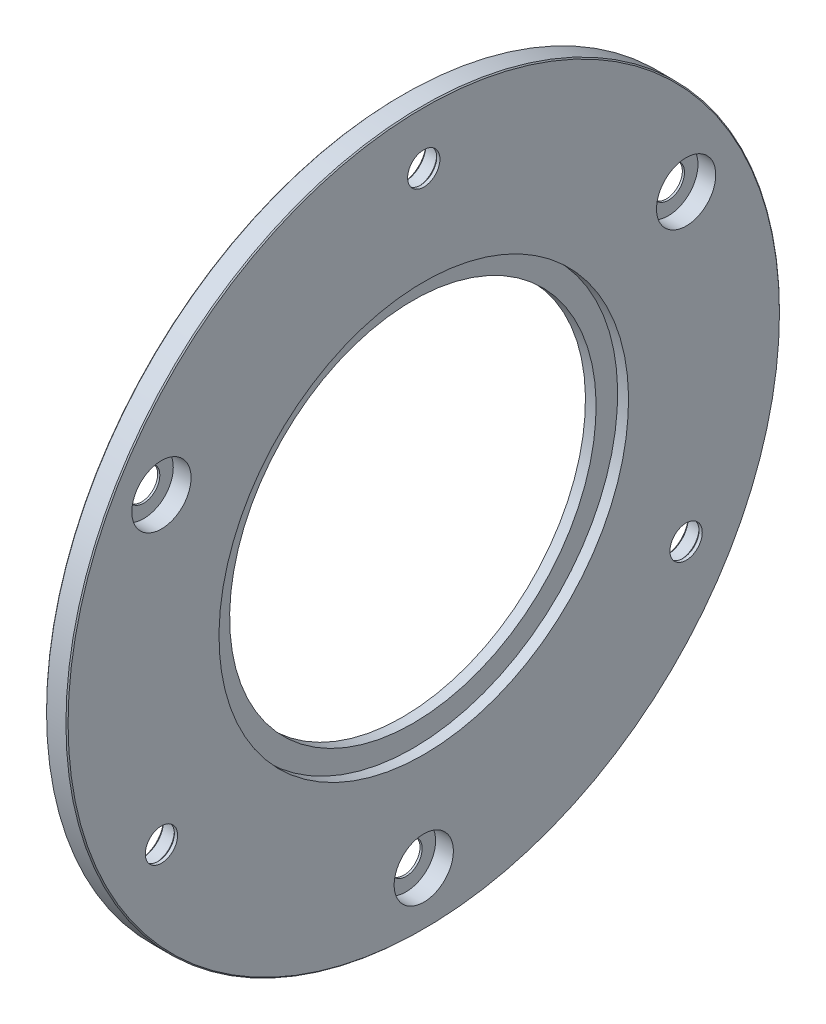
ISO-10303-21;
HEADER;
FILE_DESCRIPTION(('STEP AP214'),'2;1');
FILE_NAME('part.step','',(''),(''),'','','');
FILE_SCHEMA(('AUTOMOTIVE_DESIGN { 1 0 10303 214 1 1 1 1 }'));
ENDSEC;
DATA;
#1=APPLICATION_CONTEXT('core data for automotive mechanical design processes');
#2=APPLICATION_PROTOCOL_DEFINITION('international standard','automotive_design',2000,#1);
#3=PRODUCT_CONTEXT('',#1,'mechanical');
#4=PRODUCT('Part','Part','',(#3));
#5=PRODUCT_RELATED_PRODUCT_CATEGORY('part','',(#4));
#6=PRODUCT_DEFINITION_FORMATION('','',#4);
#7=PRODUCT_DEFINITION_CONTEXT('part definition',#1,'design');
#8=PRODUCT_DEFINITION('design','',#6,#7);
#9=PRODUCT_DEFINITION_SHAPE('','',#8);
#10=(LENGTH_UNIT() NAMED_UNIT(*) SI_UNIT(.MILLI.,.METRE.));
#11=(NAMED_UNIT(*) PLANE_ANGLE_UNIT() SI_UNIT($,.RADIAN.));
#12=(NAMED_UNIT(*) SI_UNIT($,.STERADIAN.) SOLID_ANGLE_UNIT());
#13=UNCERTAINTY_MEASURE_WITH_UNIT(LENGTH_MEASURE(1.E-05),#10,'distance_accuracy_value','');
#14=(GEOMETRIC_REPRESENTATION_CONTEXT(3) GLOBAL_UNCERTAINTY_ASSIGNED_CONTEXT((#13)) GLOBAL_UNIT_ASSIGNED_CONTEXT((#10,
#11,#12)) REPRESENTATION_CONTEXT('',''));
#15=CARTESIAN_POINT('',(0.,0.,0.));
#16=DIRECTION('',(0.,0.,1.));
#17=DIRECTION('',(1.,0.,0.));
#18=AXIS2_PLACEMENT_3D('',#15,#16,#17);
#19=CARTESIAN_POINT('',(34.,0.,0.));
#20=DIRECTION('',(1.,0.,0.));
#21=DIRECTION('',(0.,0.,-1.));
#22=AXIS2_PLACEMENT_3D('',#19,#20,#21);
#23=PLANE('',#22);
#24=CARTESIAN_POINT('',(34.,-28.1250000000002,48.7139289628746));
#25=DIRECTION('',(1.,0.,0.));
#26=DIRECTION('',(0.,0.,-1.));
#27=AXIS2_PLACEMENT_3D('',#24,#25,#26);
#28=CIRCLE('',#27,3.8);
#29=CARTESIAN_POINT('',(34.,-28.1250000000002,44.9139289628746));
#30=VERTEX_POINT('',#29);
#31=EDGE_CURVE('E71',#30,#30,#28,.F.);
#32=ORIENTED_EDGE('',*,*,#31,.T.);
#33=EDGE_LOOP('',(#32));
#34=FACE_BOUND('',#33,.T.);
#35=CARTESIAN_POINT('',(34.,-28.1250000000002,48.7139289628746));
#36=DIRECTION('',(1.,0.,0.));
#37=DIRECTION('',(0.,0.,-1.));
#38=AXIS2_PLACEMENT_3D('',#35,#36,#37);
#39=CIRCLE('',#38,3.39999999999993);
#40=CARTESIAN_POINT('',(34.,-28.1250000000002,45.3139289628746));
#41=VERTEX_POINT('',#40);
#42=EDGE_CURVE('E98',#41,#41,#39,.T.);
#43=ORIENTED_EDGE('',*,*,#42,.T.);
#44=EDGE_LOOP('',(#43));
#45=FACE_BOUND('',#44,.T.);
#46=ADVANCED_FACE('F34',(#34,#45),#23,.F.);
#47=CARTESIAN_POINT('',(34.,0.,0.));
#48=DIRECTION('',(1.,0.,0.));
#49=DIRECTION('',(0.,0.,-1.));
#50=AXIS2_PLACEMENT_3D('',#47,#48,#49);
#51=PLANE('',#50);
#52=CARTESIAN_POINT('',(34.,-28.1249999999995,-48.7139289628749));
#53=DIRECTION('',(1.,0.,0.));
#54=DIRECTION('',(0.,0.,-1.));
#55=AXIS2_PLACEMENT_3D('',#52,#53,#54);
#56=CIRCLE('',#55,3.8);
#57=CARTESIAN_POINT('',(34.,-28.1249999999995,-52.5139289628749));
#58=VERTEX_POINT('',#57);
#59=EDGE_CURVE('E55',#58,#58,#56,.F.);
#60=ORIENTED_EDGE('',*,*,#59,.T.);
#61=EDGE_LOOP('',(#60));
#62=FACE_BOUND('',#61,.T.);
#63=CARTESIAN_POINT('',(34.,-28.1249999999995,-48.7139289628749));
#64=DIRECTION('',(1.,0.,0.));
#65=DIRECTION('',(0.,0.,-1.));
#66=AXIS2_PLACEMENT_3D('',#63,#64,#65);
#67=CIRCLE('',#66,3.39999999999993);
#68=CARTESIAN_POINT('',(34.,-28.1249999999995,-52.1139289628749));
#69=VERTEX_POINT('',#68);
#70=EDGE_CURVE('E86',#69,#69,#67,.T.);
#71=ORIENTED_EDGE('',*,*,#70,.T.);
#72=EDGE_LOOP('',(#71));
#73=FACE_BOUND('',#72,.T.);
#74=ADVANCED_FACE('F241',(#62,#73),#51,.F.);
#75=CARTESIAN_POINT('',(34.,0.,0.));
#76=DIRECTION('',(1.,0.,0.));
#77=DIRECTION('',(0.,0.,-1.));
#78=AXIS2_PLACEMENT_3D('',#75,#76,#77);
#79=PLANE('',#78);
#80=CARTESIAN_POINT('',(34.,56.25,0.));
#81=DIRECTION('',(1.,0.,0.));
#82=DIRECTION('',(0.,0.,-1.));
#83=AXIS2_PLACEMENT_3D('',#80,#81,#82);
#84=CIRCLE('',#83,3.8);
#85=CARTESIAN_POINT('',(34.,56.25,-3.8));
#86=VERTEX_POINT('',#85);
#87=EDGE_CURVE('E101',#86,#86,#84,.F.);
#88=ORIENTED_EDGE('',*,*,#87,.T.);
#89=EDGE_LOOP('',(#88));
#90=FACE_BOUND('',#89,.T.);
#91=CARTESIAN_POINT('',(34.,56.25,0.));
#92=DIRECTION('',(1.,0.,0.));
#93=DIRECTION('',(0.,0.,-1.));
#94=AXIS2_PLACEMENT_3D('',#91,#92,#93);
#95=CIRCLE('',#94,3.39999999999999);
#96=CARTESIAN_POINT('',(34.,56.25,-3.39999999999999));
#97=VERTEX_POINT('',#96);
#98=EDGE_CURVE('E121',#97,#97,#95,.T.);
#99=ORIENTED_EDGE('',*,*,#98,.T.);
#100=EDGE_LOOP('',(#99));
#101=FACE_BOUND('',#100,.T.);
#102=ADVANCED_FACE('F247',(#90,#101),#79,.F.);
#103=CARTESIAN_POINT('',(33.8,56.25,0.));
#104=DIRECTION('',(1.,0.,0.));
#105=DIRECTION('',(0.,0.,-1.));
#106=AXIS2_PLACEMENT_3D('',#103,#104,#105);
#107=TOROIDAL_SURFACE('',#106,3.8,0.2);
#108=ORIENTED_EDGE('',*,*,#87,.F.);
#109=EDGE_LOOP('',(#108));
#110=FACE_BOUND('',#109,.T.);
#111=CARTESIAN_POINT('',(33.8,56.25,0.));
#112=DIRECTION('',(1.,0.,0.));
#113=DIRECTION('',(0.,0.,-1.));
#114=AXIS2_PLACEMENT_3D('',#111,#112,#113);
#115=CIRCLE('',#114,4.);
#116=CARTESIAN_POINT('',(33.8,56.25,-4.));
#117=VERTEX_POINT('',#116);
#118=EDGE_CURVE('E109',#117,#117,#115,.T.);
#119=ORIENTED_EDGE('',*,*,#118,.F.);
#120=EDGE_LOOP('',(#119));
#121=FACE_BOUND('',#120,.T.);
#122=ADVANCED_FACE('F289',(#110,#121),#107,.F.);
#123=CARTESIAN_POINT('',(35.,28.125,-48.7139289628747));
#124=DIRECTION('',(1.,0.,0.));
#125=DIRECTION('',(0.,0.,-1.));
#126=AXIS2_PLACEMENT_3D('',#123,#124,#125);
#127=CYLINDRICAL_SURFACE('',#126,3.);
#128=CARTESIAN_POINT('',(31.7,28.125,-48.7139289628747));
#129=DIRECTION('',(1.,0.,0.));
#130=DIRECTION('',(0.,0.,-1.));
#131=AXIS2_PLACEMENT_3D('',#128,#129,#130);
#132=CIRCLE('',#131,3.);
#133=CARTESIAN_POINT('',(31.7,28.125,-51.7139289628747));
#134=VERTEX_POINT('',#133);
#135=EDGE_CURVE('E106',#134,#134,#132,.T.);
#136=ORIENTED_EDGE('',*,*,#135,.T.);
#137=EDGE_LOOP('',(#136));
#138=FACE_BOUND('',#137,.T.);
#139=CARTESIAN_POINT('',(31.3,28.125,-48.7139289628747));
#140=DIRECTION('',(1.,0.,0.));
#141=DIRECTION('',(0.,0.,-1.));
#142=AXIS2_PLACEMENT_3D('',#139,#140,#141);
#143=CIRCLE('',#142,3.);
#144=CARTESIAN_POINT('',(31.3,28.125,-51.7139289628747));
#145=VERTEX_POINT('',#144);
#146=EDGE_CURVE('E102',#145,#145,#143,.T.);
#147=ORIENTED_EDGE('',*,*,#146,.F.);
#148=EDGE_LOOP('',(#147));
#149=FACE_BOUND('',#148,.T.);
#150=ADVANCED_FACE('F285',(#138,#149),#127,.F.);
#151=CARTESIAN_POINT('',(33.8,-28.1250000000002,48.7139289628746));
#152=DIRECTION('',(1.,0.,0.));
#153=DIRECTION('',(0.,0.,-1.));
#154=AXIS2_PLACEMENT_3D('',#151,#152,#153);
#155=TOROIDAL_SURFACE('',#154,3.8,0.2);
#156=ORIENTED_EDGE('',*,*,#31,.F.);
#157=EDGE_LOOP('',(#156));
#158=FACE_BOUND('',#157,.T.);
#159=CARTESIAN_POINT('',(33.8,-28.1250000000002,48.7139289628746));
#160=DIRECTION('',(1.,0.,0.));
#161=DIRECTION('',(0.,0.,-1.));
#162=AXIS2_PLACEMENT_3D('',#159,#160,#161);
#163=CIRCLE('',#162,4.);
#164=CARTESIAN_POINT('',(33.8,-28.1250000000002,44.7139289628746));
#165=VERTEX_POINT('',#164);
#166=EDGE_CURVE('E74',#165,#165,#163,.T.);
#167=ORIENTED_EDGE('',*,*,#166,.F.);
#168=EDGE_LOOP('',(#167));
#169=FACE_BOUND('',#168,.T.);
#170=ADVANCED_FACE('F288',(#158,#169),#155,.F.);
#171=CARTESIAN_POINT('',(33.8,-28.1249999999995,-48.7139289628749));
#172=DIRECTION('',(1.,0.,0.));
#173=DIRECTION('',(0.,0.,-1.));
#174=AXIS2_PLACEMENT_3D('',#171,#172,#173);
#175=TOROIDAL_SURFACE('',#174,3.8,0.2);
#176=ORIENTED_EDGE('',*,*,#59,.F.);
#177=EDGE_LOOP('',(#176));
#178=FACE_BOUND('',#177,.T.);
#179=CARTESIAN_POINT('',(33.8,-28.1249999999995,-48.7139289628749));
#180=DIRECTION('',(1.,0.,0.));
#181=DIRECTION('',(0.,0.,-1.));
#182=AXIS2_PLACEMENT_3D('',#179,#180,#181);
#183=CIRCLE('',#182,4.);
#184=CARTESIAN_POINT('',(33.8,-28.1249999999995,-52.7139289628749));
#185=VERTEX_POINT('',#184);
#186=EDGE_CURVE('E68',#185,#185,#183,.T.);
#187=ORIENTED_EDGE('',*,*,#186,.F.);
#188=EDGE_LOOP('',(#187));
#189=FACE_BOUND('',#188,.T.);
#190=ADVANCED_FACE('F354',(#178,#189),#175,.F.);
#191=CARTESIAN_POINT('',(35.,-56.25,-5.27355936696949E-13));
#192=DIRECTION('',(1.,0.,0.));
#193=DIRECTION('',(0.,0.,-1.));
#194=AXIS2_PLACEMENT_3D('',#191,#192,#193);
#195=CYLINDRICAL_SURFACE('',#194,3.);
#196=CARTESIAN_POINT('',(31.7,-56.25,-5.27355936696949E-13));
#197=DIRECTION('',(1.,0.,0.));
#198=DIRECTION('',(0.,0.,-1.));
#199=AXIS2_PLACEMENT_3D('',#196,#197,#198);
#200=CIRCLE('',#199,3.);
#201=CARTESIAN_POINT('',(31.7,-56.25,-3.00000000000053));
#202=VERTEX_POINT('',#201);
#203=EDGE_CURVE('E60',#202,#202,#200,.T.);
#204=ORIENTED_EDGE('',*,*,#203,.T.);
#205=EDGE_LOOP('',(#204));
#206=FACE_BOUND('',#205,.T.);
#207=CARTESIAN_POINT('',(31.3,-56.25,-5.27355936696949E-13));
#208=DIRECTION('',(1.,0.,0.));
#209=DIRECTION('',(0.,0.,-1.));
#210=AXIS2_PLACEMENT_3D('',#207,#208,#209);
#211=CIRCLE('',#210,3.);
#212=CARTESIAN_POINT('',(31.3,-56.25,-3.00000000000053));
#213=VERTEX_POINT('',#212);
#214=EDGE_CURVE('E56',#213,#213,#211,.T.);
#215=ORIENTED_EDGE('',*,*,#214,.F.);
#216=EDGE_LOOP('',(#215));
#217=FACE_BOUND('',#216,.T.);
#218=ADVANCED_FACE('F352',(#206,#217),#195,.F.);
#219=CARTESIAN_POINT('',(35.,28.1249999999998,48.7139289628748));
#220=DIRECTION('',(1.,0.,0.));
#221=DIRECTION('',(0.,0.,-1.));
#222=AXIS2_PLACEMENT_3D('',#219,#220,#221);
#223=CYLINDRICAL_SURFACE('',#222,3.);
#224=CARTESIAN_POINT('',(31.7,28.1249999999998,48.7139289628748));
#225=DIRECTION('',(1.,0.,0.));
#226=DIRECTION('',(0.,0.,-1.));
#227=AXIS2_PLACEMENT_3D('',#224,#225,#226);
#228=CIRCLE('',#227,3.);
#229=CARTESIAN_POINT('',(31.7,28.1249999999998,45.7139289628748));
#230=VERTEX_POINT('',#229);
#231=EDGE_CURVE('E65',#230,#230,#228,.T.);
#232=ORIENTED_EDGE('',*,*,#231,.T.);
#233=EDGE_LOOP('',(#232));
#234=FACE_BOUND('',#233,.T.);
#235=CARTESIAN_POINT('',(31.3,28.1249999999998,48.7139289628748));
#236=DIRECTION('',(1.,0.,0.));
#237=DIRECTION('',(0.,0.,-1.));
#238=AXIS2_PLACEMENT_3D('',#235,#236,#237);
#239=CIRCLE('',#238,3.);
#240=CARTESIAN_POINT('',(31.3,28.1249999999998,45.7139289628748));
#241=VERTEX_POINT('',#240);
#242=EDGE_CURVE('E61',#241,#241,#239,.T.);
#243=ORIENTED_EDGE('',*,*,#242,.F.);
#244=EDGE_LOOP('',(#243));
#245=FACE_BOUND('',#244,.T.);
#246=ADVANCED_FACE('F350',(#234,#245),#223,.F.);
#247=CARTESIAN_POINT('',(31.7,-53.25,-5.27355936696949E-13));
#248=DIRECTION('',(-1.,0.,0.));
#249=DIRECTION('',(0.,0.,1.));
#250=AXIS2_PLACEMENT_3D('',#247,#248,#249);
#251=PLANE('',#250);
#252=ORIENTED_EDGE('',*,*,#203,.F.);
#253=EDGE_LOOP('',(#252));
#254=FACE_BOUND('',#253,.T.);
#255=CARTESIAN_POINT('',(31.7,-56.25,-5.27355936696949E-13));
#256=DIRECTION('',(1.,0.,0.));
#257=DIRECTION('',(0.,0.,-1.));
#258=AXIS2_PLACEMENT_3D('',#255,#256,#257);
#259=CIRCLE('',#258,5.5);
#260=CARTESIAN_POINT('',(31.7,-56.25,-5.50000000000052));
#261=VERTEX_POINT('',#260);
#262=EDGE_CURVE('E166',#261,#261,#259,.T.);
#263=ORIENTED_EDGE('',*,*,#262,.T.);
#264=EDGE_LOOP('',(#263));
#265=FACE_BOUND('',#264,.T.);
#266=ADVANCED_FACE('F346',(#254,#265),#251,.F.);
#267=CARTESIAN_POINT('',(31.7,31.1249999999998,48.7139289628748));
#268=DIRECTION('',(-1.,0.,0.));
#269=DIRECTION('',(0.,0.,1.));
#270=AXIS2_PLACEMENT_3D('',#267,#268,#269);
#271=PLANE('',#270);
#272=ORIENTED_EDGE('',*,*,#231,.F.);
#273=EDGE_LOOP('',(#272));
#274=FACE_BOUND('',#273,.T.);
#275=CARTESIAN_POINT('',(31.7,28.1249999999998,48.7139289628748));
#276=DIRECTION('',(1.,0.,0.));
#277=DIRECTION('',(0.,0.,-1.));
#278=AXIS2_PLACEMENT_3D('',#275,#276,#277);
#279=CIRCLE('',#278,5.5);
#280=CARTESIAN_POINT('',(31.7,28.1249999999998,43.2139289628748));
#281=VERTEX_POINT('',#280);
#282=EDGE_CURVE('E159',#281,#281,#279,.T.);
#283=ORIENTED_EDGE('',*,*,#282,.T.);
#284=EDGE_LOOP('',(#283));
#285=FACE_BOUND('',#284,.T.);
#286=ADVANCED_FACE('F349',(#274,#285),#271,.F.);
#287=CARTESIAN_POINT('',(34.,-28.1250000000002,48.7139289628746));
#288=DIRECTION('',(-1.,0.,0.));
#289=DIRECTION('',(0.,0.,1.));
#290=AXIS2_PLACEMENT_3D('',#287,#288,#289);
#291=CONICAL_SURFACE('',#290,3.39999999999993,0.785398163397433);
#292=CARTESIAN_POINT('',(34.3999999999999,-28.1250000000002,48.7139289628746));
#293=DIRECTION('',(1.,0.,0.));
#294=DIRECTION('',(0.,0.,-1.));
#295=AXIS2_PLACEMENT_3D('',#292,#293,#294);
#296=CIRCLE('',#295,3.);
#297=CARTESIAN_POINT('',(34.3999999999999,-28.1250000000002,45.7139289628746));
#298=VERTEX_POINT('',#297);
#299=EDGE_CURVE('E95',#298,#298,#296,.F.);
#300=ORIENTED_EDGE('',*,*,#299,.F.);
#301=EDGE_LOOP('',(#300));
#302=FACE_BOUND('',#301,.T.);
#303=ORIENTED_EDGE('',*,*,#42,.F.);
#304=EDGE_LOOP('',(#303));
#305=FACE_BOUND('',#304,.T.);
#306=ADVANCED_FACE('F359',(#302,#305),#291,.F.);
#307=CARTESIAN_POINT('',(34.,-28.1249999999995,-48.7139289628749));
#308=DIRECTION('',(-1.,0.,0.));
#309=DIRECTION('',(0.,0.,1.));
#310=AXIS2_PLACEMENT_3D('',#307,#308,#309);
#311=CONICAL_SURFACE('',#310,3.39999999999993,0.785398163397433);
#312=CARTESIAN_POINT('',(34.3999999999999,-28.1249999999995,-48.7139289628749));
#313=DIRECTION('',(1.,0.,0.));
#314=DIRECTION('',(0.,0.,-1.));
#315=AXIS2_PLACEMENT_3D('',#312,#313,#314);
#316=CIRCLE('',#315,3.);
#317=CARTESIAN_POINT('',(34.3999999999999,-28.1249999999995,-51.7139289628749));
#318=VERTEX_POINT('',#317);
#319=EDGE_CURVE('E83',#318,#318,#316,.F.);
#320=ORIENTED_EDGE('',*,*,#319,.F.);
#321=EDGE_LOOP('',(#320));
#322=FACE_BOUND('',#321,.T.);
#323=ORIENTED_EDGE('',*,*,#70,.F.);
#324=EDGE_LOOP('',(#323));
#325=FACE_BOUND('',#324,.T.);
#326=ADVANCED_FACE('F283',(#322,#325),#311,.F.);
#327=CARTESIAN_POINT('',(31.7,31.125,-48.7139289628747));
#328=DIRECTION('',(-1.,0.,0.));
#329=DIRECTION('',(0.,0.,1.));
#330=AXIS2_PLACEMENT_3D('',#327,#328,#329);
#331=PLANE('',#330);
#332=ORIENTED_EDGE('',*,*,#135,.F.);
#333=EDGE_LOOP('',(#332));
#334=FACE_BOUND('',#333,.T.);
#335=CARTESIAN_POINT('',(31.7,28.125,-48.7139289628747));
#336=DIRECTION('',(1.,0.,0.));
#337=DIRECTION('',(0.,0.,-1.));
#338=AXIS2_PLACEMENT_3D('',#335,#336,#337);
#339=CIRCLE('',#338,5.5);
#340=CARTESIAN_POINT('',(31.7,28.125,-54.2139289628747));
#341=VERTEX_POINT('',#340);
#342=EDGE_CURVE('E134',#341,#341,#339,.T.);
#343=ORIENTED_EDGE('',*,*,#342,.T.);
#344=EDGE_LOOP('',(#343));
#345=FACE_BOUND('',#344,.T.);
#346=ADVANCED_FACE('F279',(#334,#345),#331,.F.);
#347=CARTESIAN_POINT('',(34.,56.25,0.));
#348=DIRECTION('',(-1.,0.,0.));
#349=DIRECTION('',(0.,0.,1.));
#350=AXIS2_PLACEMENT_3D('',#347,#348,#349);
#351=CONICAL_SURFACE('',#350,3.39999999999999,0.785398163397459);
#352=CARTESIAN_POINT('',(34.4,56.25,0.));
#353=DIRECTION('',(1.,0.,0.));
#354=DIRECTION('',(0.,0.,-1.));
#355=AXIS2_PLACEMENT_3D('',#352,#353,#354);
#356=CIRCLE('',#355,3.);
#357=CARTESIAN_POINT('',(34.4,56.25,-3.));
#358=VERTEX_POINT('',#357);
#359=EDGE_CURVE('E118',#358,#358,#356,.F.);
#360=ORIENTED_EDGE('',*,*,#359,.F.);
#361=EDGE_LOOP('',(#360));
#362=FACE_BOUND('',#361,.T.);
#363=ORIENTED_EDGE('',*,*,#98,.F.);
#364=EDGE_LOOP('',(#363));
#365=FACE_BOUND('',#364,.T.);
#366=ADVANCED_FACE('F282',(#362,#365),#351,.F.);
#367=CARTESIAN_POINT('',(46.3137084989848,56.25,0.));
#368=DIRECTION('',(-1.,0.,0.));
#369=DIRECTION('',(0.,0.,1.));
#370=AXIS2_PLACEMENT_3D('',#367,#368,#369);
#371=CYLINDRICAL_SURFACE('',#370,4.);
#372=ORIENTED_EDGE('',*,*,#118,.T.);
#373=EDGE_LOOP('',(#372));
#374=FACE_BOUND('',#373,.T.);
#375=CARTESIAN_POINT('',(31.3999999999999,56.25,0.));
#376=DIRECTION('',(1.,0.,0.));
#377=DIRECTION('',(0.,0.,-1.));
#378=AXIS2_PLACEMENT_3D('',#375,#376,#377);
#379=CIRCLE('',#378,4.);
#380=CARTESIAN_POINT('',(31.3999999999999,56.25,-4.));
#381=VERTEX_POINT('',#380);
#382=EDGE_CURVE('E112',#381,#381,#379,.F.);
#383=ORIENTED_EDGE('',*,*,#382,.T.);
#384=EDGE_LOOP('',(#383));
#385=FACE_BOUND('',#384,.T.);
#386=ADVANCED_FACE('F292',(#374,#385),#371,.F.);
#387=CARTESIAN_POINT('',(31.3,28.125,-48.7139289628747));
#388=DIRECTION('',(1.,0.,0.));
#389=DIRECTION('',(0.,0.,-1.));
#390=AXIS2_PLACEMENT_3D('',#387,#388,#389);
#391=PLANE('',#390);
#392=ORIENTED_EDGE('',*,*,#146,.T.);
#393=EDGE_LOOP('',(#392));
#394=FACE_BOUND('',#393,.T.);
#395=CARTESIAN_POINT('',(31.3,28.125,-48.7139289628747));
#396=DIRECTION('',(1.,0.,0.));
#397=DIRECTION('',(0.,0.,-1.));
#398=AXIS2_PLACEMENT_3D('',#395,#396,#397);
#399=CIRCLE('',#398,8.05);
#400=CARTESIAN_POINT('',(31.3,28.125,-56.7639289628747));
#401=VERTEX_POINT('',#400);
#402=EDGE_CURVE('E127',#401,#401,#399,.T.);
#403=ORIENTED_EDGE('',*,*,#402,.F.);
#404=EDGE_LOOP('',(#403));
#405=FACE_BOUND('',#404,.T.);
#406=ADVANCED_FACE('F258',(#394,#405),#391,.F.);
#407=CARTESIAN_POINT('',(46.3137084989848,-28.1250000000002,48.7139289628746));
#408=DIRECTION('',(-1.,0.,0.));
#409=DIRECTION('',(0.,0.,1.));
#410=AXIS2_PLACEMENT_3D('',#407,#408,#409);
#411=CYLINDRICAL_SURFACE('',#410,4.);
#412=ORIENTED_EDGE('',*,*,#166,.T.);
#413=EDGE_LOOP('',(#412));
#414=FACE_BOUND('',#413,.T.);
#415=CARTESIAN_POINT('',(31.3999999999999,-28.1250000000002,48.7139289628746));
#416=DIRECTION('',(1.,0.,0.));
#417=DIRECTION('',(0.,0.,-1.));
#418=AXIS2_PLACEMENT_3D('',#415,#416,#417);
#419=CIRCLE('',#418,4.);
#420=CARTESIAN_POINT('',(31.3999999999999,-28.1250000000002,44.7139289628746));
#421=VERTEX_POINT('',#420);
#422=EDGE_CURVE('E89',#421,#421,#419,.F.);
#423=ORIENTED_EDGE('',*,*,#422,.T.);
#424=EDGE_LOOP('',(#423));
#425=FACE_BOUND('',#424,.T.);
#426=ADVANCED_FACE('F255',(#414,#425),#411,.F.);
#427=CARTESIAN_POINT('',(46.3137084989848,-28.1249999999995,-48.7139289628749));
#428=DIRECTION('',(-1.,0.,0.));
#429=DIRECTION('',(0.,0.,1.));
#430=AXIS2_PLACEMENT_3D('',#427,#428,#429);
#431=CYLINDRICAL_SURFACE('',#430,4.);
#432=ORIENTED_EDGE('',*,*,#186,.T.);
#433=EDGE_LOOP('',(#432));
#434=FACE_BOUND('',#433,.T.);
#435=CARTESIAN_POINT('',(31.3999999999999,-28.1249999999995,-48.7139289628749));
#436=DIRECTION('',(1.,0.,0.));
#437=DIRECTION('',(0.,0.,-1.));
#438=AXIS2_PLACEMENT_3D('',#435,#436,#437);
#439=CIRCLE('',#438,4.);
#440=CARTESIAN_POINT('',(31.3999999999999,-28.1249999999995,-52.7139289628749));
#441=VERTEX_POINT('',#440);
#442=EDGE_CURVE('E77',#441,#441,#439,.F.);
#443=ORIENTED_EDGE('',*,*,#442,.T.);
#444=EDGE_LOOP('',(#443));
#445=FACE_BOUND('',#444,.T.);
#446=ADVANCED_FACE('F257',(#434,#445),#431,.F.);
#447=CARTESIAN_POINT('',(31.3,-56.25,-5.27355936696949E-13));
#448=DIRECTION('',(1.,0.,0.));
#449=DIRECTION('',(0.,0.,-1.));
#450=AXIS2_PLACEMENT_3D('',#447,#448,#449);
#451=PLANE('',#450);
#452=ORIENTED_EDGE('',*,*,#214,.T.);
#453=EDGE_LOOP('',(#452));
#454=FACE_BOUND('',#453,.T.);
#455=CARTESIAN_POINT('',(31.3,-56.25,-5.27355936696949E-13));
#456=DIRECTION('',(1.,0.,0.));
#457=DIRECTION('',(0.,0.,-1.));
#458=AXIS2_PLACEMENT_3D('',#455,#456,#457);
#459=CIRCLE('',#458,8.05);
#460=CARTESIAN_POINT('',(31.3,-56.25,-8.05000000000053));
#461=VERTEX_POINT('',#460);
#462=EDGE_CURVE('E149',#461,#461,#459,.T.);
#463=ORIENTED_EDGE('',*,*,#462,.F.);
#464=EDGE_LOOP('',(#463));
#465=FACE_BOUND('',#464,.T.);
#466=ADVANCED_FACE('F263',(#454,#465),#451,.F.);
#467=CARTESIAN_POINT('',(31.3,28.1249999999998,48.7139289628748));
#468=DIRECTION('',(1.,0.,0.));
#469=DIRECTION('',(0.,0.,-1.));
#470=AXIS2_PLACEMENT_3D('',#467,#468,#469);
#471=PLANE('',#470);
#472=ORIENTED_EDGE('',*,*,#242,.T.);
#473=EDGE_LOOP('',(#472));
#474=FACE_BOUND('',#473,.T.);
#475=CARTESIAN_POINT('',(31.3,28.1249999999998,48.7139289628748));
#476=DIRECTION('',(1.,0.,0.));
#477=DIRECTION('',(0.,0.,-1.));
#478=AXIS2_PLACEMENT_3D('',#475,#476,#477);
#479=CIRCLE('',#478,8.05);
#480=CARTESIAN_POINT('',(31.3,28.1249999999998,40.6639289628748));
#481=VERTEX_POINT('',#480);
#482=EDGE_CURVE('E144',#481,#481,#479,.T.);
#483=ORIENTED_EDGE('',*,*,#482,.F.);
#484=EDGE_LOOP('',(#483));
#485=FACE_BOUND('',#484,.T.);
#486=ADVANCED_FACE('F333',(#474,#485),#471,.F.);
#487=CARTESIAN_POINT('',(35.,-56.25,-5.27355936696949E-13));
#488=DIRECTION('',(1.,0.,0.));
#489=DIRECTION('',(0.,0.,-1.));
#490=AXIS2_PLACEMENT_3D('',#487,#488,#489);
#491=CYLINDRICAL_SURFACE('',#490,5.5);
#492=ORIENTED_EDGE('',*,*,#262,.F.);
#493=EDGE_LOOP('',(#492));
#494=FACE_BOUND('',#493,.T.);
#495=CARTESIAN_POINT('',(35.,-56.25,-5.27355936696949E-13));
#496=DIRECTION('',(1.,0.,0.));
#497=DIRECTION('',(0.,0.,-1.));
#498=AXIS2_PLACEMENT_3D('',#495,#496,#497);
#499=CIRCLE('',#498,5.5);
#500=CARTESIAN_POINT('',(35.,-56.25,-5.50000000000052));
#501=VERTEX_POINT('',#500);
#502=EDGE_CURVE('E169',#501,#501,#499,.T.);
#503=ORIENTED_EDGE('',*,*,#502,.T.);
#504=EDGE_LOOP('',(#503));
#505=FACE_BOUND('',#504,.T.);
#506=ADVANCED_FACE('F331',(#494,#505),#491,.F.);
#507=CARTESIAN_POINT('',(35.,28.1249999999998,48.7139289628748));
#508=DIRECTION('',(1.,0.,0.));
#509=DIRECTION('',(0.,0.,-1.));
#510=AXIS2_PLACEMENT_3D('',#507,#508,#509);
#511=CYLINDRICAL_SURFACE('',#510,5.5);
#512=ORIENTED_EDGE('',*,*,#282,.F.);
#513=EDGE_LOOP('',(#512));
#514=FACE_BOUND('',#513,.T.);
#515=CARTESIAN_POINT('',(35.,28.1249999999998,48.7139289628748));
#516=DIRECTION('',(1.,0.,0.));
#517=DIRECTION('',(0.,0.,-1.));
#518=AXIS2_PLACEMENT_3D('',#515,#516,#517);
#519=CIRCLE('',#518,5.5);
#520=CARTESIAN_POINT('',(35.,28.1249999999998,43.2139289628748));
#521=VERTEX_POINT('',#520);
#522=EDGE_CURVE('E59',#521,#521,#519,.T.);
#523=ORIENTED_EDGE('',*,*,#522,.T.);
#524=EDGE_LOOP('',(#523));
#525=FACE_BOUND('',#524,.T.);
#526=ADVANCED_FACE('F269',(#514,#525),#511,.F.);
#527=CARTESIAN_POINT('',(22.5147186257614,-28.1250000000002,48.7139289628746));
#528=DIRECTION('',(1.,0.,0.));
#529=DIRECTION('',(0.,0.,-1.));
#530=AXIS2_PLACEMENT_3D('',#527,#528,#529);
#531=CYLINDRICAL_SURFACE('',#530,3.);
#532=ORIENTED_EDGE('',*,*,#299,.T.);
#533=EDGE_LOOP('',(#532));
#534=FACE_BOUND('',#533,.T.);
#535=CARTESIAN_POINT('',(35.,-28.1250000000002,48.7139289628746));
#536=DIRECTION('',(1.,0.,0.));
#537=DIRECTION('',(0.,0.866025403784436,0.500000000000004));
#538=AXIS2_PLACEMENT_3D('',#535,#536,#537);
#539=CIRCLE('',#538,3.);
#540=CARTESIAN_POINT('',(35.,-25.5269237886469,50.2139289628746));
#541=VERTEX_POINT('',#540);
#542=EDGE_CURVE('E140',#541,#541,#539,.T.);
#543=ORIENTED_EDGE('',*,*,#542,.T.);
#544=EDGE_LOOP('',(#543));
#545=FACE_BOUND('',#544,.T.);
#546=ADVANCED_FACE('F265',(#534,#545),#531,.F.);
#547=CARTESIAN_POINT('',(22.5147186257614,-28.1249999999995,-48.7139289628749));
#548=DIRECTION('',(1.,0.,0.));
#549=DIRECTION('',(0.,0.,-1.));
#550=AXIS2_PLACEMENT_3D('',#547,#548,#549);
#551=CYLINDRICAL_SURFACE('',#550,3.);
#552=ORIENTED_EDGE('',*,*,#319,.T.);
#553=EDGE_LOOP('',(#552));
#554=FACE_BOUND('',#553,.T.);
#555=CARTESIAN_POINT('',(35.,-28.1249999999995,-48.7139289628749));
#556=DIRECTION('',(1.,0.,0.));
#557=DIRECTION('',(0.,-0.866025403784443,0.499999999999992));
#558=AXIS2_PLACEMENT_3D('',#555,#556,#557);
#559=CIRCLE('',#558,3.);
#560=CARTESIAN_POINT('',(35.,-30.7230762113529,-47.213928962875));
#561=VERTEX_POINT('',#560);
#562=EDGE_CURVE('E141',#561,#561,#559,.T.);
#563=ORIENTED_EDGE('',*,*,#562,.T.);
#564=EDGE_LOOP('',(#563));
#565=FACE_BOUND('',#564,.T.);
#566=ADVANCED_FACE('F268',(#554,#565),#551,.F.);
#567=CARTESIAN_POINT('',(35.,28.125,-48.7139289628747));
#568=DIRECTION('',(1.,0.,0.));
#569=DIRECTION('',(0.,0.,-1.));
#570=AXIS2_PLACEMENT_3D('',#567,#568,#569);
#571=CYLINDRICAL_SURFACE('',#570,5.5);
#572=ORIENTED_EDGE('',*,*,#342,.F.);
#573=EDGE_LOOP('',(#572));
#574=FACE_BOUND('',#573,.T.);
#575=CARTESIAN_POINT('',(35.,28.125,-48.7139289628747));
#576=DIRECTION('',(1.,0.,0.));
#577=DIRECTION('',(0.,0.,-1.));
#578=AXIS2_PLACEMENT_3D('',#575,#576,#577);
#579=CIRCLE('',#578,5.5);
#580=CARTESIAN_POINT('',(35.,28.125,-54.2139289628747));
#581=VERTEX_POINT('',#580);
#582=EDGE_CURVE('E137',#581,#581,#579,.T.);
#583=ORIENTED_EDGE('',*,*,#582,.T.);
#584=EDGE_LOOP('',(#583));
#585=FACE_BOUND('',#584,.T.);
#586=ADVANCED_FACE('F273',(#574,#585),#571,.F.);
#587=CARTESIAN_POINT('',(22.5147186257614,56.25,0.));
#588=DIRECTION('',(1.,0.,0.));
#589=DIRECTION('',(0.,0.,-1.));
#590=AXIS2_PLACEMENT_3D('',#587,#588,#589);
#591=CYLINDRICAL_SURFACE('',#590,3.);
#592=ORIENTED_EDGE('',*,*,#359,.T.);
#593=EDGE_LOOP('',(#592));
#594=FACE_BOUND('',#593,.T.);
#595=CARTESIAN_POINT('',(35.,56.25,0.));
#596=DIRECTION('',(1.,0.,0.));
#597=DIRECTION('',(0.,0.,-1.));
#598=AXIS2_PLACEMENT_3D('',#595,#596,#597);
#599=CIRCLE('',#598,3.);
#600=CARTESIAN_POINT('',(35.,56.25,-3.));
#601=VERTEX_POINT('',#600);
#602=EDGE_CURVE('E124',#601,#601,#599,.T.);
#603=ORIENTED_EDGE('',*,*,#602,.T.);
#604=EDGE_LOOP('',(#603));
#605=FACE_BOUND('',#604,.T.);
#606=ADVANCED_FACE('F277',(#594,#605),#591,.F.);
#607=CARTESIAN_POINT('',(35.,0.,0.));
#608=DIRECTION('',(-1.,0.,0.));
#609=DIRECTION('',(0.,0.,1.));
#610=AXIS2_PLACEMENT_3D('',#607,#608,#609);
#611=CONICAL_SURFACE('',#610,66.0500000000001,0.785398163397448);
#612=CARTESIAN_POINT('',(34.8,0.,0.));
#613=DIRECTION('',(1.,0.,0.));
#614=DIRECTION('',(0.,0.,-1.));
#615=AXIS2_PLACEMENT_3D('',#612,#613,#614);
#616=CIRCLE('',#615,66.25);
#617=CARTESIAN_POINT('',(34.8,0.,-66.25));
#618=VERTEX_POINT('',#617);
#619=EDGE_CURVE('E42',#618,#618,#616,.F.);
#620=ORIENTED_EDGE('',*,*,#619,.F.);
#621=EDGE_LOOP('',(#620));
#622=FACE_BOUND('',#621,.T.);
#623=CARTESIAN_POINT('',(35.,0.,0.));
#624=DIRECTION('',(1.,0.,0.));
#625=DIRECTION('',(0.,0.,-1.));
#626=AXIS2_PLACEMENT_3D('',#623,#624,#625);
#627=CIRCLE('',#626,66.0500000000001);
#628=CARTESIAN_POINT('',(35.,0.,-66.0500000000001));
#629=VERTEX_POINT('',#628);
#630=EDGE_CURVE('E50',#629,#629,#627,.T.);
#631=ORIENTED_EDGE('',*,*,#630,.F.);
#632=EDGE_LOOP('',(#631));
#633=FACE_BOUND('',#632,.T.);
#634=ADVANCED_FACE('F303',(#622,#633),#611,.T.);
#635=CARTESIAN_POINT('',(35.,0.,0.));
#636=DIRECTION('',(1.,0.,0.));
#637=DIRECTION('',(0.,0.,-1.));
#638=AXIS2_PLACEMENT_3D('',#635,#636,#637);
#639=PLANE('',#638);
#640=CARTESIAN_POINT('',(35.,0.,0.));
#641=DIRECTION('',(-1.,0.,0.));
#642=DIRECTION('',(0.,-1.,0.));
#643=AXIS2_PLACEMENT_3D('',#640,#641,#642);
#644=CIRCLE('',#643,38.025);
#645=CARTESIAN_POINT('',(35.,-38.025,0.));
#646=VERTEX_POINT('',#645);
#647=EDGE_CURVE('E181',#646,#646,#644,.T.);
#648=ORIENTED_EDGE('',*,*,#647,.T.);
#649=EDGE_LOOP('',(#648));
#650=FACE_BOUND('',#649,.T.);
#651=ORIENTED_EDGE('',*,*,#630,.T.);
#652=EDGE_LOOP('',(#651));
#653=FACE_BOUND('',#652,.T.);
#654=ORIENTED_EDGE('',*,*,#602,.F.);
#655=EDGE_LOOP('',(#654));
#656=FACE_BOUND('',#655,.T.);
#657=ORIENTED_EDGE('',*,*,#582,.F.);
#658=EDGE_LOOP('',(#657));
#659=FACE_BOUND('',#658,.T.);
#660=ORIENTED_EDGE('',*,*,#562,.F.);
#661=EDGE_LOOP('',(#660));
#662=FACE_BOUND('',#661,.T.);
#663=ORIENTED_EDGE('',*,*,#542,.F.);
#664=EDGE_LOOP('',(#663));
#665=FACE_BOUND('',#664,.T.);
#666=ORIENTED_EDGE('',*,*,#522,.F.);
#667=EDGE_LOOP('',(#666));
#668=FACE_BOUND('',#667,.T.);
#669=ORIENTED_EDGE('',*,*,#502,.F.);
#670=EDGE_LOOP('',(#669));
#671=FACE_BOUND('',#670,.T.);
#672=ADVANCED_FACE('F185',(#650,#653,#656,#659,#662,#665,#668,#671),#639,.T.);
#673=CARTESIAN_POINT('',(35.,0.,0.));
#674=DIRECTION('',(-1.,0.,0.));
#675=DIRECTION('',(0.,0.,1.));
#676=AXIS2_PLACEMENT_3D('',#673,#674,#675);
#677=CYLINDRICAL_SURFACE('',#676,66.25);
#678=ORIENTED_EDGE('',*,*,#619,.T.);
#679=EDGE_LOOP('',(#678));
#680=FACE_BOUND('',#679,.T.);
#681=CARTESIAN_POINT('',(31.2,0.,0.));
#682=DIRECTION('',(1.,0.,0.));
#683=DIRECTION('',(0.,0.,-1.));
#684=AXIS2_PLACEMENT_3D('',#681,#682,#683);
#685=CIRCLE('',#684,66.25);
#686=CARTESIAN_POINT('',(31.2,0.,-66.25));
#687=VERTEX_POINT('',#686);
#688=EDGE_CURVE('E46',#687,#687,#685,.T.);
#689=ORIENTED_EDGE('',*,*,#688,.T.);
#690=EDGE_LOOP('',(#689));
#691=FACE_BOUND('',#690,.T.);
#692=ADVANCED_FACE('F225',(#680,#691),#677,.T.);
#693=CARTESIAN_POINT('',(31.,56.25,0.));
#694=DIRECTION('',(-1.,0.,0.));
#695=DIRECTION('',(0.,0.,1.));
#696=AXIS2_PLACEMENT_3D('',#693,#694,#695);
#697=CONICAL_SURFACE('',#696,4.39999999999993,0.785398163397476);
#698=ORIENTED_EDGE('',*,*,#382,.F.);
#699=EDGE_LOOP('',(#698));
#700=FACE_BOUND('',#699,.T.);
#701=CARTESIAN_POINT('',(31.,56.25,0.));
#702=DIRECTION('',(1.,0.,0.));
#703=DIRECTION('',(0.,0.,-1.));
#704=AXIS2_PLACEMENT_3D('',#701,#702,#703);
#705=CIRCLE('',#704,4.39999999999993);
#706=CARTESIAN_POINT('',(31.,56.25,-4.39999999999993));
#707=VERTEX_POINT('',#706);
#708=EDGE_CURVE('E115',#707,#707,#705,.T.);
#709=ORIENTED_EDGE('',*,*,#708,.F.);
#710=EDGE_LOOP('',(#709));
#711=FACE_BOUND('',#710,.T.);
#712=ADVANCED_FACE('F222',(#700,#711),#697,.F.);
#713=CARTESIAN_POINT('',(31.3,28.125,-48.7139289628747));
#714=DIRECTION('',(-1.,0.,0.));
#715=DIRECTION('',(0.,0.,1.));
#716=AXIS2_PLACEMENT_3D('',#713,#714,#715);
#717=CYLINDRICAL_SURFACE('',#716,8.05);
#718=ORIENTED_EDGE('',*,*,#402,.T.);
#719=EDGE_LOOP('',(#718));
#720=FACE_BOUND('',#719,.T.);
#721=CARTESIAN_POINT('',(31.,28.125,-48.7139289628747));
#722=DIRECTION('',(1.,0.,0.));
#723=DIRECTION('',(0.,0.,-1.));
#724=AXIS2_PLACEMENT_3D('',#721,#722,#723);
#725=CIRCLE('',#724,8.05);
#726=CARTESIAN_POINT('',(31.,28.125,-56.7639289628747));
#727=VERTEX_POINT('',#726);
#728=EDGE_CURVE('E105',#727,#727,#725,.T.);
#729=ORIENTED_EDGE('',*,*,#728,.F.);
#730=EDGE_LOOP('',(#729));
#731=FACE_BOUND('',#730,.T.);
#732=ADVANCED_FACE('F224',(#720,#731),#717,.F.);
#733=CARTESIAN_POINT('',(31.,-28.1250000000002,48.7139289628746));
#734=DIRECTION('',(-1.,0.,0.));
#735=DIRECTION('',(0.,0.,1.));
#736=AXIS2_PLACEMENT_3D('',#733,#734,#735);
#737=CONICAL_SURFACE('',#736,4.3999999999999,0.785398163397434);
#738=ORIENTED_EDGE('',*,*,#422,.F.);
#739=EDGE_LOOP('',(#738));
#740=FACE_BOUND('',#739,.T.);
#741=CARTESIAN_POINT('',(31.,-28.1250000000002,48.7139289628746));
#742=DIRECTION('',(1.,0.,0.));
#743=DIRECTION('',(0.,0.,-1.));
#744=AXIS2_PLACEMENT_3D('',#741,#742,#743);
#745=CIRCLE('',#744,4.3999999999999);
#746=CARTESIAN_POINT('',(31.,-28.1250000000002,44.3139289628746));
#747=VERTEX_POINT('',#746);
#748=EDGE_CURVE('E92',#747,#747,#745,.T.);
#749=ORIENTED_EDGE('',*,*,#748,.F.);
#750=EDGE_LOOP('',(#749));
#751=FACE_BOUND('',#750,.T.);
#752=ADVANCED_FACE('F232',(#740,#751),#737,.F.);
#753=CARTESIAN_POINT('',(31.,-28.1249999999995,-48.7139289628749));
#754=DIRECTION('',(-1.,0.,0.));
#755=DIRECTION('',(0.,0.,1.));
#756=AXIS2_PLACEMENT_3D('',#753,#754,#755);
#757=CONICAL_SURFACE('',#756,4.3999999999999,0.785398163397434);
#758=ORIENTED_EDGE('',*,*,#442,.F.);
#759=EDGE_LOOP('',(#758));
#760=FACE_BOUND('',#759,.T.);
#761=CARTESIAN_POINT('',(31.,-28.1249999999995,-48.7139289628749));
#762=DIRECTION('',(1.,0.,0.));
#763=DIRECTION('',(0.,0.,-1.));
#764=AXIS2_PLACEMENT_3D('',#761,#762,#763);
#765=CIRCLE('',#764,4.3999999999999);
#766=CARTESIAN_POINT('',(31.,-28.1249999999995,-53.1139289628748));
#767=VERTEX_POINT('',#766);
#768=EDGE_CURVE('E80',#767,#767,#765,.T.);
#769=ORIENTED_EDGE('',*,*,#768,.F.);
#770=EDGE_LOOP('',(#769));
#771=FACE_BOUND('',#770,.T.);
#772=ADVANCED_FACE('F377',(#760,#771),#757,.F.);
#773=CARTESIAN_POINT('',(31.3,-56.25,-5.27355936696949E-13));
#774=DIRECTION('',(-1.,0.,0.));
#775=DIRECTION('',(0.,0.,1.));
#776=AXIS2_PLACEMENT_3D('',#773,#774,#775);
#777=CYLINDRICAL_SURFACE('',#776,8.05);
#778=ORIENTED_EDGE('',*,*,#462,.T.);
#779=EDGE_LOOP('',(#778));
#780=FACE_BOUND('',#779,.T.);
#781=CARTESIAN_POINT('',(31.,-56.25,-5.27355936696949E-13));
#782=DIRECTION('',(1.,0.,0.));
#783=DIRECTION('',(0.,0.,-1.));
#784=AXIS2_PLACEMENT_3D('',#781,#782,#783);
#785=CIRCLE('',#784,8.05);
#786=CARTESIAN_POINT('',(31.,-56.25,-8.05000000000053));
#787=VERTEX_POINT('',#786);
#788=EDGE_CURVE('E64',#787,#787,#785,.T.);
#789=ORIENTED_EDGE('',*,*,#788,.F.);
#790=EDGE_LOOP('',(#789));
#791=FACE_BOUND('',#790,.T.);
#792=ADVANCED_FACE('F253',(#780,#791),#777,.F.);
#793=CARTESIAN_POINT('',(31.3,28.1249999999998,48.7139289628748));
#794=DIRECTION('',(-1.,0.,0.));
#795=DIRECTION('',(0.,0.,1.));
#796=AXIS2_PLACEMENT_3D('',#793,#794,#795);
#797=CYLINDRICAL_SURFACE('',#796,8.05);
#798=ORIENTED_EDGE('',*,*,#482,.T.);
#799=EDGE_LOOP('',(#798));
#800=FACE_BOUND('',#799,.T.);
#801=CARTESIAN_POINT('',(31.,28.1249999999998,48.7139289628748));
#802=DIRECTION('',(1.,0.,0.));
#803=DIRECTION('',(0.,0.,-1.));
#804=AXIS2_PLACEMENT_3D('',#801,#802,#803);
#805=CIRCLE('',#804,8.05);
#806=CARTESIAN_POINT('',(31.,28.1249999999998,40.6639289628748));
#807=VERTEX_POINT('',#806);
#808=EDGE_CURVE('E152',#807,#807,#805,.T.);
#809=ORIENTED_EDGE('',*,*,#808,.F.);
#810=EDGE_LOOP('',(#809));
#811=FACE_BOUND('',#810,.T.);
#812=ADVANCED_FACE('F364',(#800,#811),#797,.F.);
#813=CARTESIAN_POINT('',(31.2,0.,0.));
#814=DIRECTION('',(1.,0.,0.));
#815=DIRECTION('',(0.,0.,-1.));
#816=AXIS2_PLACEMENT_3D('',#813,#814,#815);
#817=CONICAL_SURFACE('',#816,66.25,0.785398163397414);
#818=CARTESIAN_POINT('',(31.,0.,0.));
#819=DIRECTION('',(1.,0.,0.));
#820=DIRECTION('',(0.,0.,-1.));
#821=AXIS2_PLACEMENT_3D('',#818,#819,#820);
#822=CIRCLE('',#821,66.05);
#823=CARTESIAN_POINT('',(31.,0.,-66.05));
#824=VERTEX_POINT('',#823);
#825=EDGE_CURVE('E11',#824,#824,#822,.F.);
#826=ORIENTED_EDGE('',*,*,#825,.F.);
#827=EDGE_LOOP('',(#826));
#828=FACE_BOUND('',#827,.T.);
#829=ORIENTED_EDGE('',*,*,#688,.F.);
#830=EDGE_LOOP('',(#829));
#831=FACE_BOUND('',#830,.T.);
#832=ADVANCED_FACE('F37',(#828,#831),#817,.T.);
#833=CARTESIAN_POINT('',(31.,0.,0.));
#834=DIRECTION('',(1.,0.,0.));
#835=DIRECTION('',(0.,0.,-1.));
#836=AXIS2_PLACEMENT_3D('',#833,#834,#835);
#837=PLANE('',#836);
#838=CARTESIAN_POINT('',(31.,0.,0.));
#839=DIRECTION('',(-1.,0.,0.));
#840=DIRECTION('',(0.,-1.,0.));
#841=AXIS2_PLACEMENT_3D('',#838,#839,#840);
#842=CIRCLE('',#841,34.025);
#843=CARTESIAN_POINT('',(31.,-34.025,0.));
#844=VERTEX_POINT('',#843);
#845=EDGE_CURVE('E172',#844,#844,#842,.T.);
#846=ORIENTED_EDGE('',*,*,#845,.F.);
#847=EDGE_LOOP('',(#846));
#848=FACE_BOUND('',#847,.T.);
#849=ORIENTED_EDGE('',*,*,#825,.T.);
#850=EDGE_LOOP('',(#849));
#851=FACE_BOUND('',#850,.T.);
#852=ORIENTED_EDGE('',*,*,#808,.T.);
#853=EDGE_LOOP('',(#852));
#854=FACE_BOUND('',#853,.T.);
#855=ORIENTED_EDGE('',*,*,#788,.T.);
#856=EDGE_LOOP('',(#855));
#857=FACE_BOUND('',#856,.T.);
#858=ORIENTED_EDGE('',*,*,#768,.T.);
#859=EDGE_LOOP('',(#858));
#860=FACE_BOUND('',#859,.T.);
#861=ORIENTED_EDGE('',*,*,#748,.T.);
#862=EDGE_LOOP('',(#861));
#863=FACE_BOUND('',#862,.T.);
#864=ORIENTED_EDGE('',*,*,#728,.T.);
#865=EDGE_LOOP('',(#864));
#866=FACE_BOUND('',#865,.T.);
#867=ORIENTED_EDGE('',*,*,#708,.T.);
#868=EDGE_LOOP('',(#867));
#869=FACE_BOUND('',#868,.T.);
#870=ADVANCED_FACE('F192',(#848,#851,#854,#857,#860,#863,#866,#869),#837,.F.);
#871=CARTESIAN_POINT('',(31.,0.,0.));
#872=DIRECTION('',(-1.,0.,0.));
#873=DIRECTION('',(0.,-1.,0.));
#874=AXIS2_PLACEMENT_3D('',#871,#872,#873);
#875=CYLINDRICAL_SURFACE('',#874,38.025);
#876=ORIENTED_EDGE('',*,*,#647,.F.);
#877=EDGE_LOOP('',(#876));
#878=FACE_BOUND('',#877,.T.);
#879=CARTESIAN_POINT('',(32.975,0.,0.));
#880=DIRECTION('',(-1.,0.,0.));
#881=DIRECTION('',(0.,-1.,0.));
#882=AXIS2_PLACEMENT_3D('',#879,#880,#881);
#883=CIRCLE('',#882,38.025);
#884=CARTESIAN_POINT('',(32.975,-38.025,0.));
#885=VERTEX_POINT('',#884);
#886=EDGE_CURVE('E178',#885,#885,#883,.T.);
#887=ORIENTED_EDGE('',*,*,#886,.T.);
#888=EDGE_LOOP('',(#887));
#889=FACE_BOUND('',#888,.T.);
#890=ADVANCED_FACE('F188',(#878,#889),#875,.F.);
#891=CARTESIAN_POINT('',(32.975,34.,0.));
#892=DIRECTION('',(-1.,0.,0.));
#893=DIRECTION('',(0.,-1.,0.));
#894=AXIS2_PLACEMENT_3D('',#891,#892,#893);
#895=PLANE('',#894);
#896=ORIENTED_EDGE('',*,*,#886,.F.);
#897=EDGE_LOOP('',(#896));
#898=FACE_BOUND('',#897,.T.);
#899=CARTESIAN_POINT('',(32.975,0.,0.));
#900=DIRECTION('',(-1.,0.,0.));
#901=DIRECTION('',(0.,-1.,0.));
#902=AXIS2_PLACEMENT_3D('',#899,#900,#901);
#903=CIRCLE('',#902,34.025);
#904=CARTESIAN_POINT('',(32.975,-34.025,0.));
#905=VERTEX_POINT('',#904);
#906=EDGE_CURVE('E175',#905,#905,#903,.T.);
#907=ORIENTED_EDGE('',*,*,#906,.T.);
#908=EDGE_LOOP('',(#907));
#909=FACE_BOUND('',#908,.T.);
#910=ADVANCED_FACE('F191',(#898,#909),#895,.F.);
#911=CARTESIAN_POINT('',(31.,0.,0.));
#912=DIRECTION('',(-1.,0.,0.));
#913=DIRECTION('',(0.,-1.,0.));
#914=AXIS2_PLACEMENT_3D('',#911,#912,#913);
#915=CYLINDRICAL_SURFACE('',#914,34.025);
#916=ORIENTED_EDGE('',*,*,#906,.F.);
#917=EDGE_LOOP('',(#916));
#918=FACE_BOUND('',#917,.T.);
#919=ORIENTED_EDGE('',*,*,#845,.T.);
#920=EDGE_LOOP('',(#919));
#921=FACE_BOUND('',#920,.T.);
#922=ADVANCED_FACE('F198',(#918,#921),#915,.F.);
#923=CLOSED_SHELL('',(#46,#74,#102,#122,#150,#170,#190,#218,#246,#266,#286,#306,#326,#346,#366,
#386,#406,#426,#446,#466,#486,#506,#526,#546,#566,#586,#606,#634,#672,#692,#712,#732,#752,#772,
#792,#812,#832,#870,#890,#910,#922));
#924=MANIFOLD_SOLID_BREP('B2',#923);
#925=ADVANCED_BREP_SHAPE_REPRESENTATION('',(#18,#924),#14);
#926=SHAPE_DEFINITION_REPRESENTATION(#9,#925);
ENDSEC;
END-ISO-10303-21;
